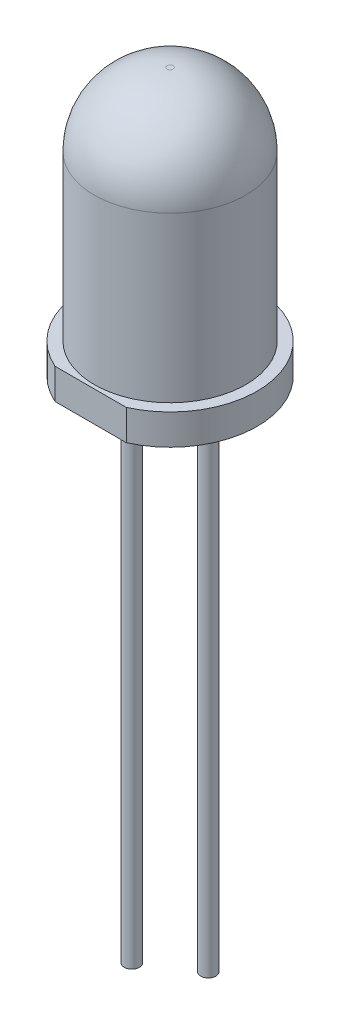
ISO-10303-21;
HEADER;
FILE_DESCRIPTION(('STEP AP214'),'2;1');
FILE_NAME('part.step','',(''),(''),'','','');
FILE_SCHEMA(('AUTOMOTIVE_DESIGN { 1 0 10303 214 1 1 1 1 }'));
ENDSEC;
DATA;
#1=APPLICATION_CONTEXT('core data for automotive mechanical design processes');
#2=APPLICATION_PROTOCOL_DEFINITION('international standard','automotive_design',2000,#1);
#3=PRODUCT_CONTEXT('',#1,'mechanical');
#4=PRODUCT('Part','Part','',(#3));
#5=PRODUCT_RELATED_PRODUCT_CATEGORY('part','',(#4));
#6=PRODUCT_DEFINITION_FORMATION('','',#4);
#7=PRODUCT_DEFINITION_CONTEXT('part definition',#1,'design');
#8=PRODUCT_DEFINITION('design','',#6,#7);
#9=PRODUCT_DEFINITION_SHAPE('','',#8);
#10=(LENGTH_UNIT() NAMED_UNIT(*) SI_UNIT(.MILLI.,.METRE.));
#11=(NAMED_UNIT(*) PLANE_ANGLE_UNIT() SI_UNIT($,.RADIAN.));
#12=(NAMED_UNIT(*) SI_UNIT($,.STERADIAN.) SOLID_ANGLE_UNIT());
#13=UNCERTAINTY_MEASURE_WITH_UNIT(LENGTH_MEASURE(1.E-05),#10,'distance_accuracy_value','');
#14=(GEOMETRIC_REPRESENTATION_CONTEXT(3) GLOBAL_UNCERTAINTY_ASSIGNED_CONTEXT((#13)) GLOBAL_UNIT_ASSIGNED_CONTEXT((#10,
#11,#12)) REPRESENTATION_CONTEXT('',''));
#15=CARTESIAN_POINT('',(0.,0.,0.));
#16=DIRECTION('',(0.,0.,1.));
#17=DIRECTION('',(1.,0.,0.));
#18=AXIS2_PLACEMENT_3D('',#15,#16,#17);
#19=CARTESIAN_POINT('',(0.,0.,0.));
#20=DIRECTION('',(0.,-1.,0.));
#21=DIRECTION('',(0.,0.,-1.));
#22=AXIS2_PLACEMENT_3D('',#19,#20,#21);
#23=PLANE('',#22);
#24=CARTESIAN_POINT('',(0.,0.,1.25));
#25=DIRECTION('',(0.,-1.,0.));
#26=DIRECTION('',(0.,0.,-1.));
#27=AXIS2_PLACEMENT_3D('',#24,#25,#26);
#28=CIRCLE('',#27,0.25);
#29=CARTESIAN_POINT('',(0.,0.,1.));
#30=VERTEX_POINT('',#29);
#31=EDGE_CURVE('E87',#30,#30,#28,.T.);
#32=ORIENTED_EDGE('',*,*,#31,.F.);
#33=EDGE_LOOP('',(#32));
#34=FACE_BOUND('',#33,.T.);
#35=CARTESIAN_POINT('',(0.,0.,-1.25));
#36=DIRECTION('',(0.,-1.,0.));
#37=DIRECTION('',(0.,0.,-1.));
#38=AXIS2_PLACEMENT_3D('',#35,#36,#37);
#39=CIRCLE('',#38,0.25);
#40=CARTESIAN_POINT('',(0.,0.,-1.5));
#41=VERTEX_POINT('',#40);
#42=EDGE_CURVE('E83',#41,#41,#39,.T.);
#43=ORIENTED_EDGE('',*,*,#42,.F.);
#44=EDGE_LOOP('',(#43));
#45=FACE_BOUND('',#44,.T.);
#46=DIRECTION('',(1.,0.,0.));
#47=VECTOR('',#46,1.);
#48=CARTESIAN_POINT('',(-1.16726175299288,0.,2.6));
#49=LINE('',#48,#47);
#50=CARTESIAN_POINT('',(-1.16726175299288,0.,2.6));
#51=VERTEX_POINT('',#50);
#52=CARTESIAN_POINT('',(1.16726175299288,0.,2.6));
#53=VERTEX_POINT('',#52);
#54=EDGE_CURVE('E63',#51,#53,#49,.T.);
#55=ORIENTED_EDGE('',*,*,#54,.F.);
#56=CARTESIAN_POINT('',(0.,0.,0.));
#57=DIRECTION('',(0.,-1.,0.));
#58=DIRECTION('',(0.,0.,-1.));
#59=AXIS2_PLACEMENT_3D('',#56,#57,#58);
#60=CIRCLE('',#59,2.85);
#61=EDGE_CURVE('E11',#51,#53,#60,.T.);
#62=ORIENTED_EDGE('',*,*,#61,.T.);
#63=EDGE_LOOP('',(#55,#62));
#64=FACE_BOUND('',#63,.T.);
#65=ADVANCED_FACE('F34',(#34,#45,#64),#23,.T.);
#66=CARTESIAN_POINT('',(0.,0.,0.));
#67=DIRECTION('',(0.,-1.,0.));
#68=DIRECTION('',(0.,0.,-1.));
#69=AXIS2_PLACEMENT_3D('',#66,#67,#68);
#70=CYLINDRICAL_SURFACE('',#69,2.85);
#71=DIRECTION('',(0.,-1.,0.));
#72=VECTOR('',#71,1.);
#73=CARTESIAN_POINT('',(1.16726175299288,3.34787137637478,2.6));
#74=LINE('',#73,#72);
#75=CARTESIAN_POINT('',(1.16726175299288,1.,2.6));
#76=VERTEX_POINT('',#75);
#77=EDGE_CURVE('E48',#76,#53,#74,.T.);
#78=ORIENTED_EDGE('',*,*,#77,.T.);
#79=ORIENTED_EDGE('',*,*,#61,.F.);
#80=DIRECTION('',(0.,-1.,0.));
#81=VECTOR('',#80,1.);
#82=CARTESIAN_POINT('',(-1.16726175299288,3.34787137637478,2.6));
#83=LINE('',#82,#81);
#84=CARTESIAN_POINT('',(-1.16726175299288,1.,2.6));
#85=VERTEX_POINT('',#84);
#86=EDGE_CURVE('E54',#85,#51,#83,.T.);
#87=ORIENTED_EDGE('',*,*,#86,.F.);
#88=CARTESIAN_POINT('',(0.,1.,0.));
#89=DIRECTION('',(0.,-1.,0.));
#90=DIRECTION('',(0.,0.,-1.));
#91=AXIS2_PLACEMENT_3D('',#88,#89,#90);
#92=CIRCLE('',#91,2.85);
#93=EDGE_CURVE('E41',#85,#76,#92,.T.);
#94=ORIENTED_EDGE('',*,*,#93,.T.);
#95=EDGE_LOOP('',(#78,#79,#87,#94));
#96=FACE_BOUND('',#95,.T.);
#97=ADVANCED_FACE('F67',(#96),#70,.T.);
#98=CARTESIAN_POINT('',(2.85,1.,0.));
#99=DIRECTION('',(0.,1.,0.));
#100=DIRECTION('',(0.,0.,1.));
#101=AXIS2_PLACEMENT_3D('',#98,#99,#100);
#102=PLANE('',#101);
#103=DIRECTION('',(1.,0.,0.));
#104=VECTOR('',#103,1.);
#105=CARTESIAN_POINT('',(-1.16726175299288,1.,2.6));
#106=LINE('',#105,#104);
#107=EDGE_CURVE('E58',#85,#76,#106,.T.);
#108=ORIENTED_EDGE('',*,*,#107,.T.);
#109=ORIENTED_EDGE('',*,*,#93,.F.);
#110=EDGE_LOOP('',(#108,#109));
#111=FACE_BOUND('',#110,.T.);
#112=CARTESIAN_POINT('',(0.,1.,0.));
#113=DIRECTION('',(0.,-1.,0.));
#114=DIRECTION('',(0.,0.,-1.));
#115=AXIS2_PLACEMENT_3D('',#112,#113,#114);
#116=CIRCLE('',#115,2.48);
#117=CARTESIAN_POINT('',(0.,1.,-2.48));
#118=VERTEX_POINT('',#117);
#119=EDGE_CURVE('E72',#118,#118,#116,.T.);
#120=ORIENTED_EDGE('',*,*,#119,.T.);
#121=EDGE_LOOP('',(#120));
#122=FACE_BOUND('',#121,.T.);
#123=ADVANCED_FACE('F70',(#111,#122),#102,.T.);
#124=CARTESIAN_POINT('',(0.,0.,0.));
#125=DIRECTION('',(0.,-1.,0.));
#126=DIRECTION('',(0.,0.,-1.));
#127=AXIS2_PLACEMENT_3D('',#124,#125,#126);
#128=CYLINDRICAL_SURFACE('',#127,2.48);
#129=CARTESIAN_POINT('',(0.,6.37,0.));
#130=DIRECTION('',(0.,-1.,0.));
#131=DIRECTION('',(0.,0.,-1.));
#132=AXIS2_PLACEMENT_3D('',#129,#130,#131);
#133=CIRCLE('',#132,2.48);
#134=CARTESIAN_POINT('',(0.,6.37,-2.48));
#135=VERTEX_POINT('',#134);
#136=EDGE_CURVE('E74',#135,#135,#133,.T.);
#137=ORIENTED_EDGE('',*,*,#136,.T.);
#138=EDGE_LOOP('',(#137));
#139=FACE_BOUND('',#138,.T.);
#140=ORIENTED_EDGE('',*,*,#119,.F.);
#141=EDGE_LOOP('',(#140));
#142=FACE_BOUND('',#141,.T.);
#143=ADVANCED_FACE('F125',(#139,#142),#128,.T.);
#144=CARTESIAN_POINT('',(0.,6.37,0.));
#145=DIRECTION('',(0.,-1.,0.));
#146=DIRECTION('',(0.,0.,-1.));
#147=AXIS2_PLACEMENT_3D('',#144,#145,#146);
#148=DEGENERATE_TOROIDAL_SURFACE('',#147,0.1,2.38,.T.);
#149=CARTESIAN_POINT('',(0.,8.75,0.));
#150=DIRECTION('',(0.,-1.,0.));
#151=DIRECTION('',(0.,0.,-1.));
#152=AXIS2_PLACEMENT_3D('',#149,#150,#151);
#153=CIRCLE('',#152,0.1);
#154=CARTESIAN_POINT('',(0.,8.75,-0.1));
#155=VERTEX_POINT('',#154);
#156=EDGE_CURVE('E68',#155,#155,#153,.T.);
#157=ORIENTED_EDGE('',*,*,#156,.T.);
#158=EDGE_LOOP('',(#157));
#159=FACE_BOUND('',#158,.T.);
#160=ORIENTED_EDGE('',*,*,#136,.F.);
#161=EDGE_LOOP('',(#160));
#162=FACE_BOUND('',#161,.T.);
#163=ADVANCED_FACE('F130',(#159,#162),#148,.T.);
#164=CARTESIAN_POINT('',(0.,8.75,0.));
#165=DIRECTION('',(0.,1.,0.));
#166=DIRECTION('',(0.,0.,1.));
#167=AXIS2_PLACEMENT_3D('',#164,#165,#166);
#168=PLANE('',#167);
#169=ORIENTED_EDGE('',*,*,#156,.F.);
#170=EDGE_LOOP('',(#169));
#171=FACE_BOUND('',#170,.T.);
#172=ADVANCED_FACE('F110',(#171),#168,.T.);
#173=CARTESIAN_POINT('',(-1.16726175299288,3.34787137637478,2.6));
#174=DIRECTION('',(0.,0.,-1.));
#175=DIRECTION('',(-1.,0.,0.));
#176=AXIS2_PLACEMENT_3D('',#173,#174,#175);
#177=PLANE('',#176);
#178=ORIENTED_EDGE('',*,*,#86,.T.);
#179=ORIENTED_EDGE('',*,*,#54,.T.);
#180=ORIENTED_EDGE('',*,*,#77,.F.);
#181=ORIENTED_EDGE('',*,*,#107,.F.);
#182=EDGE_LOOP('',(#178,#179,#180,#181));
#183=FACE_BOUND('',#182,.T.);
#184=ADVANCED_FACE('F59',(#183),#177,.F.);
#185=CARTESIAN_POINT('',(0.,-16.,-1.25));
#186=DIRECTION('',(0.,1.,0.));
#187=DIRECTION('',(0.,0.,1.));
#188=AXIS2_PLACEMENT_3D('',#185,#186,#187);
#189=CYLINDRICAL_SURFACE('',#188,0.25);
#190=ORIENTED_EDGE('',*,*,#42,.T.);
#191=EDGE_LOOP('',(#190));
#192=FACE_BOUND('',#191,.T.);
#193=CARTESIAN_POINT('',(0.,-17.5,-1.25));
#194=DIRECTION('',(0.,-1.,0.));
#195=DIRECTION('',(0.,0.,-1.));
#196=AXIS2_PLACEMENT_3D('',#193,#194,#195);
#197=CIRCLE('',#196,0.25);
#198=CARTESIAN_POINT('',(0.,-17.5,-1.5));
#199=VERTEX_POINT('',#198);
#200=EDGE_CURVE('E90',#199,#199,#197,.T.);
#201=ORIENTED_EDGE('',*,*,#200,.F.);
#202=EDGE_LOOP('',(#201));
#203=FACE_BOUND('',#202,.T.);
#204=ADVANCED_FACE('F98',(#192,#203),#189,.T.);
#205=CARTESIAN_POINT('',(0.,-16.,1.25));
#206=DIRECTION('',(0.,1.,0.));
#207=DIRECTION('',(0.,0.,1.));
#208=AXIS2_PLACEMENT_3D('',#205,#206,#207);
#209=CYLINDRICAL_SURFACE('',#208,0.25);
#210=CARTESIAN_POINT('',(0.,-16.,1.25));
#211=DIRECTION('',(0.,-1.,0.));
#212=DIRECTION('',(0.,0.,-1.));
#213=AXIS2_PLACEMENT_3D('',#210,#211,#212);
#214=CIRCLE('',#213,0.25);
#215=CARTESIAN_POINT('',(0.,-16.,1.));
#216=VERTEX_POINT('',#215);
#217=EDGE_CURVE('E86',#216,#216,#214,.T.);
#218=ORIENTED_EDGE('',*,*,#217,.F.);
#219=EDGE_LOOP('',(#218));
#220=FACE_BOUND('',#219,.T.);
#221=ORIENTED_EDGE('',*,*,#31,.T.);
#222=EDGE_LOOP('',(#221));
#223=FACE_BOUND('',#222,.T.);
#224=ADVANCED_FACE('F100',(#220,#223),#209,.T.);
#225=CARTESIAN_POINT('',(0.,-16.,1.25));
#226=DIRECTION('',(0.,-1.,0.));
#227=DIRECTION('',(0.,0.,-1.));
#228=AXIS2_PLACEMENT_3D('',#225,#226,#227);
#229=PLANE('',#228);
#230=ORIENTED_EDGE('',*,*,#217,.T.);
#231=EDGE_LOOP('',(#230));
#232=FACE_BOUND('',#231,.T.);
#233=ADVANCED_FACE('F107',(#232),#229,.T.);
#234=CARTESIAN_POINT('',(0.,-17.5,-1.25));
#235=DIRECTION('',(0.,-1.,0.));
#236=DIRECTION('',(0.,0.,-1.));
#237=AXIS2_PLACEMENT_3D('',#234,#235,#236);
#238=PLANE('',#237);
#239=ORIENTED_EDGE('',*,*,#200,.T.);
#240=EDGE_LOOP('',(#239));
#241=FACE_BOUND('',#240,.T.);
#242=ADVANCED_FACE('F96',(#241),#238,.T.);
#243=CLOSED_SHELL('',(#65,#97,#123,#143,#163,#172,#184,#204,#224,#233,#242));
#244=MANIFOLD_SOLID_BREP('B2',#243);
#245=ADVANCED_BREP_SHAPE_REPRESENTATION('',(#18,#244),#14);
#246=SHAPE_DEFINITION_REPRESENTATION(#9,#245);
ENDSEC;
END-ISO-10303-21;
